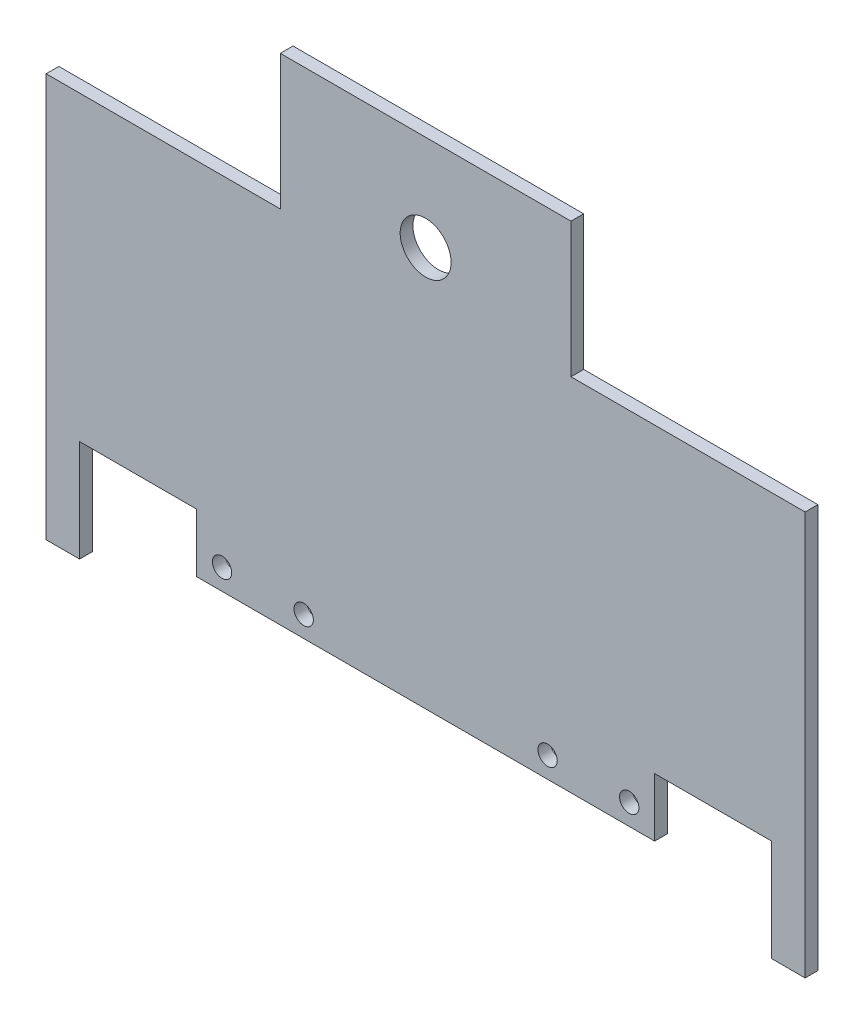
ISO-10303-21;
HEADER;
FILE_DESCRIPTION(('STEP AP214'),'2;1');
FILE_NAME('part.step','',(''),(''),'','','');
FILE_SCHEMA(('AUTOMOTIVE_DESIGN { 1 0 10303 214 1 1 1 1 }'));
ENDSEC;
DATA;
#1=APPLICATION_CONTEXT('core data for automotive mechanical design processes');
#2=APPLICATION_PROTOCOL_DEFINITION('international standard','automotive_design',2000,#1);
#3=PRODUCT_CONTEXT('',#1,'mechanical');
#4=PRODUCT('Part','Part','',(#3));
#5=PRODUCT_RELATED_PRODUCT_CATEGORY('part','',(#4));
#6=PRODUCT_DEFINITION_FORMATION('','',#4);
#7=PRODUCT_DEFINITION_CONTEXT('part definition',#1,'design');
#8=PRODUCT_DEFINITION('design','',#6,#7);
#9=PRODUCT_DEFINITION_SHAPE('','',#8);
#10=(LENGTH_UNIT() NAMED_UNIT(*) SI_UNIT(.MILLI.,.METRE.));
#11=(NAMED_UNIT(*) PLANE_ANGLE_UNIT() SI_UNIT($,.RADIAN.));
#12=(NAMED_UNIT(*) SI_UNIT($,.STERADIAN.) SOLID_ANGLE_UNIT());
#13=UNCERTAINTY_MEASURE_WITH_UNIT(LENGTH_MEASURE(1.E-05),#10,'distance_accuracy_value','');
#14=(GEOMETRIC_REPRESENTATION_CONTEXT(3) GLOBAL_UNCERTAINTY_ASSIGNED_CONTEXT((#13)) GLOBAL_UNIT_ASSIGNED_CONTEXT((#10,
#11,#12)) REPRESENTATION_CONTEXT('',''));
#15=CARTESIAN_POINT('',(0.,0.,0.));
#16=DIRECTION('',(0.,0.,1.));
#17=DIRECTION('',(1.,0.,0.));
#18=AXIS2_PLACEMENT_3D('',#15,#16,#17);
#19=CARTESIAN_POINT('',(0.,0.,3.175));
#20=DIRECTION('',(0.,0.,1.));
#21=DIRECTION('',(1.,0.,0.));
#22=AXIS2_PLACEMENT_3D('',#19,#20,#21);
#23=PLANE('',#22);
#24=CARTESIAN_POINT('',(-52.9106534090909,-24.5679046590909,3.175));
#25=DIRECTION('',(0.,0.,1.));
#26=DIRECTION('',(-1.,0.,0.));
#27=AXIS2_PLACEMENT_3D('',#24,#25,#26);
#28=CIRCLE('',#27,2.413);
#29=CARTESIAN_POINT('',(-55.3236534090909,-24.5679046590909,3.175));
#30=VERTEX_POINT('',#29);
#31=EDGE_CURVE('E350',#30,#30,#28,.T.);
#32=ORIENTED_EDGE('',*,*,#31,.F.);
#33=EDGE_LOOP('',(#32));
#34=FACE_BOUND('',#33,.T.);
#35=CARTESIAN_POINT('',(28.3220150937922,-24.5679046590909,3.175));
#36=DIRECTION('',(0.,0.,1.));
#37=DIRECTION('',(1.,0.,0.));
#38=AXIS2_PLACEMENT_3D('',#35,#36,#37);
#39=CIRCLE('',#38,2.413);
#40=CARTESIAN_POINT('',(30.7350150937922,-24.5679046590909,3.175));
#41=VERTEX_POINT('',#40);
#42=EDGE_CURVE('E362',#41,#41,#39,.T.);
#43=ORIENTED_EDGE('',*,*,#42,.F.);
#44=EDGE_LOOP('',(#43));
#45=FACE_BOUND('',#44,.T.);
#46=DIRECTION('',(0.,1.,0.));
#47=VECTOR('',#46,1.);
#48=CARTESIAN_POINT('',(34.1519507752537,60.1261658208276,3.175));
#49=LINE('',#48,#47);
#50=CARTESIAN_POINT('',(34.1519507752537,60.1261658208276,3.175));
#51=VERTEX_POINT('',#50);
#52=CARTESIAN_POINT('',(34.1519507752537,93.7570312870619,3.175));
#53=VERTEX_POINT('',#52);
#54=EDGE_CURVE('E212',#51,#53,#49,.T.);
#55=ORIENTED_EDGE('',*,*,#54,.T.);
#56=DIRECTION('',(-1.,0.,0.));
#57=VECTOR('',#56,1.);
#58=CARTESIAN_POINT('',(34.1519507752537,93.7570312870619,3.175));
#59=LINE('',#58,#57);
#60=CARTESIAN_POINT('',(-38.3732575934355,93.7570312870619,3.175));
#61=VERTEX_POINT('',#60);
#62=EDGE_CURVE('E118',#53,#61,#59,.T.);
#63=ORIENTED_EDGE('',*,*,#62,.T.);
#64=DIRECTION('',(0.,-1.,0.));
#65=VECTOR('',#64,1.);
#66=CARTESIAN_POINT('',(-38.3732575934355,60.1261658208276,3.175));
#67=LINE('',#66,#65);
#68=CARTESIAN_POINT('',(-38.3732575934355,60.1261658208276,3.175));
#69=VERTEX_POINT('',#68);
#70=EDGE_CURVE('E251',#61,#69,#67,.T.);
#71=ORIENTED_EDGE('',*,*,#70,.T.);
#72=DIRECTION('',(-1.,0.,0.));
#73=VECTOR('',#72,1.);
#74=CARTESIAN_POINT('',(-38.3732575934355,60.1261658208276,3.175));
#75=LINE('',#74,#73);
#76=CARTESIAN_POINT('',(-96.8158838000753,60.1261658208276,3.175));
#77=VERTEX_POINT('',#76);
#78=EDGE_CURVE('E269',#69,#77,#75,.T.);
#79=ORIENTED_EDGE('',*,*,#78,.T.);
#80=DIRECTION('',(0.,-1.,0.));
#81=VECTOR('',#80,1.);
#82=CARTESIAN_POINT('',(-96.8158838000753,60.1261658208276,3.175));
#83=LINE('',#82,#81);
#84=CARTESIAN_POINT('',(-96.8158838000753,-40.5902246590909,3.175));
#85=VERTEX_POINT('',#84);
#86=EDGE_CURVE('E266',#77,#85,#83,.T.);
#87=ORIENTED_EDGE('',*,*,#86,.T.);
#88=DIRECTION('',(1.,0.,0.));
#89=VECTOR('',#88,1.);
#90=CARTESIAN_POINT('',(-88.4706534090909,-40.5902246590909,3.175));
#91=LINE('',#90,#89);
#92=CARTESIAN_POINT('',(-88.4706534090909,-40.5902246590909,3.175));
#93=VERTEX_POINT('',#92);
#94=EDGE_CURVE('E268',#85,#93,#91,.T.);
#95=ORIENTED_EDGE('',*,*,#94,.T.);
#96=DIRECTION('',(0.,1.,0.));
#97=VECTOR('',#96,1.);
#98=CARTESIAN_POINT('',(-88.4706534090909,-15.1902246590909,3.175));
#99=LINE('',#98,#97);
#100=CARTESIAN_POINT('',(-88.4706534090909,-15.1902246590909,3.175));
#101=VERTEX_POINT('',#100);
#102=EDGE_CURVE('E271',#93,#101,#99,.T.);
#103=ORIENTED_EDGE('',*,*,#102,.T.);
#104=DIRECTION('',(1.,0.,0.));
#105=VECTOR('',#104,1.);
#106=CARTESIAN_POINT('',(-59.2606534090909,-15.1902246590909,3.175));
#107=LINE('',#106,#105);
#108=CARTESIAN_POINT('',(-59.2606534090909,-15.1902246590909,3.175));
#109=VERTEX_POINT('',#108);
#110=EDGE_CURVE('E277',#101,#109,#107,.T.);
#111=ORIENTED_EDGE('',*,*,#110,.T.);
#112=DIRECTION('',(0.,-1.,0.));
#113=VECTOR('',#112,1.);
#114=CARTESIAN_POINT('',(-59.2606534090909,-15.1902246590909,3.175));
#115=LINE('',#114,#113);
#116=CARTESIAN_POINT('',(-59.2606534090909,-29.7926846590909,3.175));
#117=VERTEX_POINT('',#116);
#118=EDGE_CURVE('E279',#109,#117,#115,.T.);
#119=ORIENTED_EDGE('',*,*,#118,.T.);
#120=DIRECTION('',(1.,0.,0.));
#121=VECTOR('',#120,1.);
#122=CARTESIAN_POINT('',(-59.2606534090909,-29.7926846590909,3.175));
#123=LINE('',#122,#121);
#124=CARTESIAN_POINT('',(55.0393465909091,-29.7926846590909,3.175));
#125=VERTEX_POINT('',#124);
#126=EDGE_CURVE('E281',#117,#125,#123,.T.);
#127=ORIENTED_EDGE('',*,*,#126,.T.);
#128=DIRECTION('',(0.,1.,0.));
#129=VECTOR('',#128,1.);
#130=CARTESIAN_POINT('',(55.0393465909091,-15.1902246590909,3.175));
#131=LINE('',#130,#129);
#132=CARTESIAN_POINT('',(55.0393465909091,-15.1902246590909,3.175));
#133=VERTEX_POINT('',#132);
#134=EDGE_CURVE('E283',#125,#133,#131,.T.);
#135=ORIENTED_EDGE('',*,*,#134,.T.);
#136=DIRECTION('',(1.,0.,0.));
#137=VECTOR('',#136,1.);
#138=CARTESIAN_POINT('',(55.0393465909091,-15.1902246590909,3.175));
#139=LINE('',#138,#137);
#140=CARTESIAN_POINT('',(84.249346590909,-15.1902246590909,3.175));
#141=VERTEX_POINT('',#140);
#142=EDGE_CURVE('E285',#133,#141,#139,.T.);
#143=ORIENTED_EDGE('',*,*,#142,.T.);
#144=DIRECTION('',(0.,-1.,0.));
#145=VECTOR('',#144,1.);
#146=CARTESIAN_POINT('',(84.249346590909,-15.1902246590909,3.175));
#147=LINE('',#146,#145);
#148=CARTESIAN_POINT('',(84.2493465909091,-40.5902246590909,3.175));
#149=VERTEX_POINT('',#148);
#150=EDGE_CURVE('E161',#141,#149,#147,.T.);
#151=ORIENTED_EDGE('',*,*,#150,.T.);
#152=DIRECTION('',(1.,0.,0.));
#153=VECTOR('',#152,1.);
#154=CARTESIAN_POINT('',(84.2493465909091,-40.5902246590909,3.175));
#155=LINE('',#154,#153);
#156=CARTESIAN_POINT('',(92.5945769818935,-40.5902246590909,3.175));
#157=VERTEX_POINT('',#156);
#158=EDGE_CURVE('E155',#149,#157,#155,.T.);
#159=ORIENTED_EDGE('',*,*,#158,.T.);
#160=DIRECTION('',(0.,1.,0.));
#161=VECTOR('',#160,1.);
#162=CARTESIAN_POINT('',(92.5945769818934,-6.87794744777601,3.175));
#163=LINE('',#162,#161);
#164=CARTESIAN_POINT('',(92.5945769818934,60.1261658208276,3.175));
#165=VERTEX_POINT('',#164);
#166=EDGE_CURVE('E159',#157,#165,#163,.T.);
#167=ORIENTED_EDGE('',*,*,#166,.T.);
#168=DIRECTION('',(-1.,0.,0.));
#169=VECTOR('',#168,1.);
#170=CARTESIAN_POINT('',(92.5945769818934,60.1261658208276,3.175));
#171=LINE('',#170,#169);
#172=EDGE_CURVE('E52',#165,#51,#171,.T.);
#173=ORIENTED_EDGE('',*,*,#172,.T.);
#174=EDGE_LOOP('',(#55,#63,#71,#79,#87,#95,#103,#111,#119,#127,#135,#143,#151,#159,#167,#173));
#175=FACE_BOUND('',#174,.T.);
#176=CARTESIAN_POINT('',(48.6893465909091,-24.5679046590909,3.175));
#177=DIRECTION('',(0.,0.,1.));
#178=DIRECTION('',(1.,0.,0.));
#179=AXIS2_PLACEMENT_3D('',#176,#177,#178);
#180=CIRCLE('',#179,2.413);
#181=CARTESIAN_POINT('',(51.1023465909091,-24.5679046590909,3.175));
#182=VERTEX_POINT('',#181);
#183=EDGE_CURVE('E184',#182,#182,#180,.T.);
#184=ORIENTED_EDGE('',*,*,#183,.F.);
#185=EDGE_LOOP('',(#184));
#186=FACE_BOUND('',#185,.T.);
#187=CARTESIAN_POINT('',(-32.543321911974,-24.5679046590909,3.175));
#188=DIRECTION('',(0.,0.,1.));
#189=DIRECTION('',(-1.,0.,0.));
#190=AXIS2_PLACEMENT_3D('',#187,#188,#189);
#191=CIRCLE('',#190,2.41300000000001);
#192=CARTESIAN_POINT('',(-34.956321911974,-24.5679046590909,3.175));
#193=VERTEX_POINT('',#192);
#194=EDGE_CURVE('E356',#193,#193,#191,.T.);
#195=ORIENTED_EDGE('',*,*,#194,.F.);
#196=EDGE_LOOP('',(#195));
#197=FACE_BOUND('',#196,.T.);
#198=CARTESIAN_POINT('',(-2.11065340909093,69.8925240613448,3.175));
#199=DIRECTION('',(0.,0.,1.));
#200=DIRECTION('',(1.,0.,0.));
#201=AXIS2_PLACEMENT_3D('',#198,#199,#200);
#202=CIRCLE('',#201,6.35);
#203=CARTESIAN_POINT('',(4.23934659090907,69.8925240613448,3.175));
#204=VERTEX_POINT('',#203);
#205=EDGE_CURVE('E341',#204,#204,#202,.T.);
#206=ORIENTED_EDGE('',*,*,#205,.F.);
#207=EDGE_LOOP('',(#206));
#208=FACE_BOUND('',#207,.T.);
#209=ADVANCED_FACE('F35',(#34,#45,#175,#186,#197,#208),#23,.T.);
#210=CARTESIAN_POINT('',(0.,0.,0.));
#211=DIRECTION('',(0.,0.,1.));
#212=DIRECTION('',(1.,0.,0.));
#213=AXIS2_PLACEMENT_3D('',#210,#211,#212);
#214=PLANE('',#213);
#215=CARTESIAN_POINT('',(-52.9106534090909,-24.5679046590909,0.));
#216=DIRECTION('',(0.,0.,1.));
#217=DIRECTION('',(-1.,0.,0.));
#218=AXIS2_PLACEMENT_3D('',#215,#216,#217);
#219=CIRCLE('',#218,2.413);
#220=CARTESIAN_POINT('',(-55.3236534090909,-24.5679046590909,0.));
#221=VERTEX_POINT('',#220);
#222=EDGE_CURVE('E347',#221,#221,#219,.T.);
#223=ORIENTED_EDGE('',*,*,#222,.T.);
#224=EDGE_LOOP('',(#223));
#225=FACE_BOUND('',#224,.T.);
#226=CARTESIAN_POINT('',(28.3220150937922,-24.5679046590909,0.));
#227=DIRECTION('',(0.,0.,1.));
#228=DIRECTION('',(1.,0.,0.));
#229=AXIS2_PLACEMENT_3D('',#226,#227,#228);
#230=CIRCLE('',#229,2.413);
#231=CARTESIAN_POINT('',(30.7350150937922,-24.5679046590909,0.));
#232=VERTEX_POINT('',#231);
#233=EDGE_CURVE('E359',#232,#232,#230,.T.);
#234=ORIENTED_EDGE('',*,*,#233,.T.);
#235=EDGE_LOOP('',(#234));
#236=FACE_BOUND('',#235,.T.);
#237=DIRECTION('',(0.,1.,0.));
#238=VECTOR('',#237,1.);
#239=CARTESIAN_POINT('',(34.1519507752537,60.1261658208276,0.));
#240=LINE('',#239,#238);
#241=CARTESIAN_POINT('',(34.1519507752537,60.1261658208276,0.));
#242=VERTEX_POINT('',#241);
#243=CARTESIAN_POINT('',(34.1519507752537,93.7570312870619,0.));
#244=VERTEX_POINT('',#243);
#245=EDGE_CURVE('E180',#242,#244,#240,.T.);
#246=ORIENTED_EDGE('',*,*,#245,.F.);
#247=DIRECTION('',(-1.,0.,0.));
#248=VECTOR('',#247,1.);
#249=CARTESIAN_POINT('',(92.5945769818934,60.1261658208276,0.));
#250=LINE('',#249,#248);
#251=CARTESIAN_POINT('',(92.5945769818934,60.1261658208276,0.));
#252=VERTEX_POINT('',#251);
#253=EDGE_CURVE('E110',#252,#242,#250,.T.);
#254=ORIENTED_EDGE('',*,*,#253,.F.);
#255=DIRECTION('',(0.,1.,0.));
#256=VECTOR('',#255,1.);
#257=CARTESIAN_POINT('',(92.5945769818934,-6.87794744777601,0.));
#258=LINE('',#257,#256);
#259=CARTESIAN_POINT('',(92.5945769818935,-40.5902246590909,0.));
#260=VERTEX_POINT('',#259);
#261=EDGE_CURVE('E104',#260,#252,#258,.T.);
#262=ORIENTED_EDGE('',*,*,#261,.F.);
#263=DIRECTION('',(1.,0.,0.));
#264=VECTOR('',#263,1.);
#265=CARTESIAN_POINT('',(84.2493465909091,-40.5902246590909,0.));
#266=LINE('',#265,#264);
#267=CARTESIAN_POINT('',(84.2493465909091,-40.5902246590909,0.));
#268=VERTEX_POINT('',#267);
#269=EDGE_CURVE('E170',#268,#260,#266,.T.);
#270=ORIENTED_EDGE('',*,*,#269,.F.);
#271=DIRECTION('',(0.,-1.,0.));
#272=VECTOR('',#271,1.);
#273=CARTESIAN_POINT('',(84.249346590909,-15.1902246590909,0.));
#274=LINE('',#273,#272);
#275=CARTESIAN_POINT('',(84.249346590909,-15.1902246590909,0.));
#276=VERTEX_POINT('',#275);
#277=EDGE_CURVE('E207',#276,#268,#274,.T.);
#278=ORIENTED_EDGE('',*,*,#277,.F.);
#279=DIRECTION('',(1.,0.,0.));
#280=VECTOR('',#279,1.);
#281=CARTESIAN_POINT('',(55.0393465909091,-15.1902246590909,0.));
#282=LINE('',#281,#280);
#283=CARTESIAN_POINT('',(55.0393465909091,-15.1902246590909,0.));
#284=VERTEX_POINT('',#283);
#285=EDGE_CURVE('E205',#284,#276,#282,.T.);
#286=ORIENTED_EDGE('',*,*,#285,.F.);
#287=DIRECTION('',(0.,1.,0.));
#288=VECTOR('',#287,1.);
#289=CARTESIAN_POINT('',(55.0393465909091,-15.1902246590909,0.));
#290=LINE('',#289,#288);
#291=CARTESIAN_POINT('',(55.0393465909091,-29.7926846590909,0.));
#292=VERTEX_POINT('',#291);
#293=EDGE_CURVE('E203',#292,#284,#290,.T.);
#294=ORIENTED_EDGE('',*,*,#293,.F.);
#295=DIRECTION('',(1.,0.,0.));
#296=VECTOR('',#295,1.);
#297=CARTESIAN_POINT('',(-59.2606534090909,-29.7926846590909,0.));
#298=LINE('',#297,#296);
#299=CARTESIAN_POINT('',(-59.2606534090909,-29.7926846590909,0.));
#300=VERTEX_POINT('',#299);
#301=EDGE_CURVE('E201',#300,#292,#298,.T.);
#302=ORIENTED_EDGE('',*,*,#301,.F.);
#303=DIRECTION('',(0.,-1.,0.));
#304=VECTOR('',#303,1.);
#305=CARTESIAN_POINT('',(-59.2606534090909,-15.1902246590909,0.));
#306=LINE('',#305,#304);
#307=CARTESIAN_POINT('',(-59.2606534090909,-15.1902246590909,0.));
#308=VERTEX_POINT('',#307);
#309=EDGE_CURVE('E199',#308,#300,#306,.T.);
#310=ORIENTED_EDGE('',*,*,#309,.F.);
#311=DIRECTION('',(1.,0.,0.));
#312=VECTOR('',#311,1.);
#313=CARTESIAN_POINT('',(-59.2606534090909,-15.1902246590909,0.));
#314=LINE('',#313,#312);
#315=CARTESIAN_POINT('',(-88.4706534090909,-15.1902246590909,0.));
#316=VERTEX_POINT('',#315);
#317=EDGE_CURVE('E197',#316,#308,#314,.T.);
#318=ORIENTED_EDGE('',*,*,#317,.F.);
#319=DIRECTION('',(0.,1.,0.));
#320=VECTOR('',#319,1.);
#321=CARTESIAN_POINT('',(-88.4706534090909,-15.1902246590909,0.));
#322=LINE('',#321,#320);
#323=CARTESIAN_POINT('',(-88.4706534090909,-40.5902246590909,0.));
#324=VERTEX_POINT('',#323);
#325=EDGE_CURVE('E195',#324,#316,#322,.T.);
#326=ORIENTED_EDGE('',*,*,#325,.F.);
#327=DIRECTION('',(1.,0.,0.));
#328=VECTOR('',#327,1.);
#329=CARTESIAN_POINT('',(-88.4706534090909,-40.5902246590909,0.));
#330=LINE('',#329,#328);
#331=CARTESIAN_POINT('',(-96.8158838000753,-40.5902246590909,0.));
#332=VERTEX_POINT('',#331);
#333=EDGE_CURVE('E193',#332,#324,#330,.T.);
#334=ORIENTED_EDGE('',*,*,#333,.F.);
#335=DIRECTION('',(0.,-1.,0.));
#336=VECTOR('',#335,1.);
#337=CARTESIAN_POINT('',(-96.8158838000753,-6.87794744777604,0.));
#338=LINE('',#337,#336);
#339=CARTESIAN_POINT('',(-96.8158838000753,60.1261658208276,0.));
#340=VERTEX_POINT('',#339);
#341=EDGE_CURVE('E191',#340,#332,#338,.T.);
#342=ORIENTED_EDGE('',*,*,#341,.F.);
#343=DIRECTION('',(-1.,0.,0.));
#344=VECTOR('',#343,1.);
#345=CARTESIAN_POINT('',(-38.3732575934355,60.1261658208276,0.));
#346=LINE('',#345,#344);
#347=CARTESIAN_POINT('',(-38.3732575934355,60.1261658208276,0.));
#348=VERTEX_POINT('',#347);
#349=EDGE_CURVE('E188',#348,#340,#346,.T.);
#350=ORIENTED_EDGE('',*,*,#349,.F.);
#351=DIRECTION('',(0.,-1.,0.));
#352=VECTOR('',#351,1.);
#353=CARTESIAN_POINT('',(-38.3732575934355,60.1261658208276,0.));
#354=LINE('',#353,#352);
#355=CARTESIAN_POINT('',(-38.3732575934355,93.7570312870619,0.));
#356=VERTEX_POINT('',#355);
#357=EDGE_CURVE('E186',#356,#348,#354,.T.);
#358=ORIENTED_EDGE('',*,*,#357,.F.);
#359=DIRECTION('',(-1.,0.,0.));
#360=VECTOR('',#359,1.);
#361=CARTESIAN_POINT('',(34.1519507752537,93.7570312870619,0.));
#362=LINE('',#361,#360);
#363=EDGE_CURVE('E183',#244,#356,#362,.T.);
#364=ORIENTED_EDGE('',*,*,#363,.F.);
#365=EDGE_LOOP('',(#246,#254,#262,#270,#278,#286,#294,#302,#310,#318,#326,#334,#342,#350,#358,#364));
#366=FACE_BOUND('',#365,.T.);
#367=CARTESIAN_POINT('',(48.6893465909091,-24.5679046590909,0.));
#368=DIRECTION('',(0.,0.,1.));
#369=DIRECTION('',(1.,0.,0.));
#370=AXIS2_PLACEMENT_3D('',#367,#368,#369);
#371=CIRCLE('',#370,2.413);
#372=CARTESIAN_POINT('',(51.1023465909091,-24.5679046590909,0.));
#373=VERTEX_POINT('',#372);
#374=EDGE_CURVE('E365',#373,#373,#371,.T.);
#375=ORIENTED_EDGE('',*,*,#374,.T.);
#376=EDGE_LOOP('',(#375));
#377=FACE_BOUND('',#376,.T.);
#378=CARTESIAN_POINT('',(-32.543321911974,-24.5679046590909,0.));
#379=DIRECTION('',(0.,0.,1.));
#380=DIRECTION('',(-1.,0.,0.));
#381=AXIS2_PLACEMENT_3D('',#378,#379,#380);
#382=CIRCLE('',#381,2.41300000000001);
#383=CARTESIAN_POINT('',(-34.956321911974,-24.5679046590909,0.));
#384=VERTEX_POINT('',#383);
#385=EDGE_CURVE('E353',#384,#384,#382,.T.);
#386=ORIENTED_EDGE('',*,*,#385,.T.);
#387=EDGE_LOOP('',(#386));
#388=FACE_BOUND('',#387,.T.);
#389=CARTESIAN_POINT('',(-2.11065340909093,69.8925240613448,0.));
#390=DIRECTION('',(0.,0.,1.));
#391=DIRECTION('',(1.,0.,0.));
#392=AXIS2_PLACEMENT_3D('',#389,#390,#391);
#393=CIRCLE('',#392,6.35);
#394=CARTESIAN_POINT('',(4.23934659090907,69.8925240613448,0.));
#395=VERTEX_POINT('',#394);
#396=EDGE_CURVE('E344',#395,#395,#393,.T.);
#397=ORIENTED_EDGE('',*,*,#396,.T.);
#398=EDGE_LOOP('',(#397));
#399=FACE_BOUND('',#398,.T.);
#400=ADVANCED_FACE('F255',(#225,#236,#366,#377,#388,#399),#214,.F.);
#401=CARTESIAN_POINT('',(34.1519507752537,60.1261658208276,3.175));
#402=DIRECTION('',(-1.,0.,0.));
#403=DIRECTION('',(0.,0.,1.));
#404=AXIS2_PLACEMENT_3D('',#401,#402,#403);
#405=PLANE('',#404);
#406=ORIENTED_EDGE('',*,*,#245,.T.);
#407=DIRECTION('',(0.,0.,-1.));
#408=VECTOR('',#407,1.);
#409=CARTESIAN_POINT('',(34.1519507752537,93.7570312870619,3.175));
#410=LINE('',#409,#408);
#411=EDGE_CURVE('E11',#53,#244,#410,.T.);
#412=ORIENTED_EDGE('',*,*,#411,.F.);
#413=ORIENTED_EDGE('',*,*,#54,.F.);
#414=DIRECTION('',(0.,0.,-1.));
#415=VECTOR('',#414,1.);
#416=CARTESIAN_POINT('',(34.1519507752537,60.1261658208276,3.175));
#417=LINE('',#416,#415);
#418=EDGE_CURVE('E176',#51,#242,#417,.T.);
#419=ORIENTED_EDGE('',*,*,#418,.T.);
#420=EDGE_LOOP('',(#406,#412,#413,#419));
#421=FACE_BOUND('',#420,.T.);
#422=ADVANCED_FACE('F37',(#421),#405,.F.);
#423=CARTESIAN_POINT('',(34.1519507752537,93.7570312870619,3.175));
#424=DIRECTION('',(0.,-1.,0.));
#425=DIRECTION('',(0.,0.,-1.));
#426=AXIS2_PLACEMENT_3D('',#423,#424,#425);
#427=PLANE('',#426);
#428=ORIENTED_EDGE('',*,*,#363,.T.);
#429=DIRECTION('',(0.,0.,-1.));
#430=VECTOR('',#429,1.);
#431=CARTESIAN_POINT('',(-38.3732575934355,93.7570312870619,3.175));
#432=LINE('',#431,#430);
#433=EDGE_CURVE('E44',#61,#356,#432,.T.);
#434=ORIENTED_EDGE('',*,*,#433,.F.);
#435=ORIENTED_EDGE('',*,*,#62,.F.);
#436=ORIENTED_EDGE('',*,*,#411,.T.);
#437=EDGE_LOOP('',(#428,#434,#435,#436));
#438=FACE_BOUND('',#437,.T.);
#439=ADVANCED_FACE('F525',(#438),#427,.F.);
#440=CARTESIAN_POINT('',(-38.3732575934355,60.1261658208276,3.175));
#441=DIRECTION('',(1.,0.,0.));
#442=DIRECTION('',(0.,0.,-1.));
#443=AXIS2_PLACEMENT_3D('',#440,#441,#442);
#444=PLANE('',#443);
#445=ORIENTED_EDGE('',*,*,#357,.T.);
#446=DIRECTION('',(0.,0.,-1.));
#447=VECTOR('',#446,1.);
#448=CARTESIAN_POINT('',(-38.3732575934355,60.1261658208276,3.175));
#449=LINE('',#448,#447);
#450=EDGE_CURVE('E243',#69,#348,#449,.T.);
#451=ORIENTED_EDGE('',*,*,#450,.F.);
#452=ORIENTED_EDGE('',*,*,#70,.F.);
#453=ORIENTED_EDGE('',*,*,#433,.T.);
#454=EDGE_LOOP('',(#445,#451,#452,#453));
#455=FACE_BOUND('',#454,.T.);
#456=ADVANCED_FACE('F249',(#455),#444,.F.);
#457=CARTESIAN_POINT('',(-38.3732575934355,60.1261658208276,3.175));
#458=DIRECTION('',(0.,-1.,0.));
#459=DIRECTION('',(0.,0.,-1.));
#460=AXIS2_PLACEMENT_3D('',#457,#458,#459);
#461=PLANE('',#460);
#462=ORIENTED_EDGE('',*,*,#349,.T.);
#463=DIRECTION('',(0.,0.,-1.));
#464=VECTOR('',#463,1.);
#465=CARTESIAN_POINT('',(-96.8158838000753,60.1261658208276,3.175));
#466=LINE('',#465,#464);
#467=EDGE_CURVE('E240',#77,#340,#466,.T.);
#468=ORIENTED_EDGE('',*,*,#467,.F.);
#469=ORIENTED_EDGE('',*,*,#78,.F.);
#470=ORIENTED_EDGE('',*,*,#450,.T.);
#471=EDGE_LOOP('',(#462,#468,#469,#470));
#472=FACE_BOUND('',#471,.T.);
#473=ADVANCED_FACE('F260',(#472),#461,.F.);
#474=CARTESIAN_POINT('',(-96.8158838000753,-6.87794744777604,3.175));
#475=DIRECTION('',(1.,0.,0.));
#476=DIRECTION('',(0.,0.,-1.));
#477=AXIS2_PLACEMENT_3D('',#474,#475,#476);
#478=PLANE('',#477);
#479=ORIENTED_EDGE('',*,*,#341,.T.);
#480=DIRECTION('',(0.,0.,-1.));
#481=VECTOR('',#480,1.);
#482=CARTESIAN_POINT('',(-96.8158838000753,-40.5902246590909,3.175));
#483=LINE('',#482,#481);
#484=EDGE_CURVE('E237',#85,#332,#483,.T.);
#485=ORIENTED_EDGE('',*,*,#484,.F.);
#486=ORIENTED_EDGE('',*,*,#86,.F.);
#487=ORIENTED_EDGE('',*,*,#467,.T.);
#488=EDGE_LOOP('',(#479,#485,#486,#487));
#489=FACE_BOUND('',#488,.T.);
#490=ADVANCED_FACE('F264',(#489),#478,.F.);
#491=CARTESIAN_POINT('',(-88.4706534090909,-40.5902246590909,3.175));
#492=DIRECTION('',(0.,1.,0.));
#493=DIRECTION('',(0.,0.,1.));
#494=AXIS2_PLACEMENT_3D('',#491,#492,#493);
#495=PLANE('',#494);
#496=ORIENTED_EDGE('',*,*,#333,.T.);
#497=DIRECTION('',(0.,0.,-1.));
#498=VECTOR('',#497,1.);
#499=CARTESIAN_POINT('',(-88.4706534090909,-40.5902246590909,3.175));
#500=LINE('',#499,#498);
#501=EDGE_CURVE('E234',#93,#324,#500,.T.);
#502=ORIENTED_EDGE('',*,*,#501,.F.);
#503=ORIENTED_EDGE('',*,*,#94,.F.);
#504=ORIENTED_EDGE('',*,*,#484,.T.);
#505=EDGE_LOOP('',(#496,#502,#503,#504));
#506=FACE_BOUND('',#505,.T.);
#507=ADVANCED_FACE('F489',(#506),#495,.F.);
#508=CARTESIAN_POINT('',(-88.4706534090909,-15.1902246590909,3.175));
#509=DIRECTION('',(-1.,0.,0.));
#510=DIRECTION('',(0.,-1.,0.));
#511=AXIS2_PLACEMENT_3D('',#508,#509,#510);
#512=PLANE('',#511);
#513=ORIENTED_EDGE('',*,*,#325,.T.);
#514=DIRECTION('',(0.,0.,-1.));
#515=VECTOR('',#514,1.);
#516=CARTESIAN_POINT('',(-88.4706534090909,-15.1902246590909,3.175));
#517=LINE('',#516,#515);
#518=EDGE_CURVE('E231',#101,#316,#517,.T.);
#519=ORIENTED_EDGE('',*,*,#518,.F.);
#520=ORIENTED_EDGE('',*,*,#102,.F.);
#521=ORIENTED_EDGE('',*,*,#501,.T.);
#522=EDGE_LOOP('',(#513,#519,#520,#521));
#523=FACE_BOUND('',#522,.T.);
#524=ADVANCED_FACE('F479',(#523),#512,.F.);
#525=CARTESIAN_POINT('',(-59.2606534090909,-15.1902246590909,3.175));
#526=DIRECTION('',(0.,1.,0.));
#527=DIRECTION('',(-1.,0.,0.));
#528=AXIS2_PLACEMENT_3D('',#525,#526,#527);
#529=PLANE('',#528);
#530=ORIENTED_EDGE('',*,*,#317,.T.);
#531=DIRECTION('',(0.,0.,-1.));
#532=VECTOR('',#531,1.);
#533=CARTESIAN_POINT('',(-59.2606534090909,-15.1902246590909,3.175));
#534=LINE('',#533,#532);
#535=EDGE_CURVE('E228',#109,#308,#534,.T.);
#536=ORIENTED_EDGE('',*,*,#535,.F.);
#537=ORIENTED_EDGE('',*,*,#110,.F.);
#538=ORIENTED_EDGE('',*,*,#518,.T.);
#539=EDGE_LOOP('',(#530,#536,#537,#538));
#540=FACE_BOUND('',#539,.T.);
#541=ADVANCED_FACE('F469',(#540),#529,.F.);
#542=CARTESIAN_POINT('',(-59.2606534090909,-15.1902246590909,3.175));
#543=DIRECTION('',(1.,0.,0.));
#544=DIRECTION('',(0.,1.,0.));
#545=AXIS2_PLACEMENT_3D('',#542,#543,#544);
#546=PLANE('',#545);
#547=ORIENTED_EDGE('',*,*,#309,.T.);
#548=DIRECTION('',(0.,0.,-1.));
#549=VECTOR('',#548,1.);
#550=CARTESIAN_POINT('',(-59.2606534090909,-29.7926846590909,3.175));
#551=LINE('',#550,#549);
#552=EDGE_CURVE('E225',#117,#300,#551,.T.);
#553=ORIENTED_EDGE('',*,*,#552,.F.);
#554=ORIENTED_EDGE('',*,*,#118,.F.);
#555=ORIENTED_EDGE('',*,*,#535,.T.);
#556=EDGE_LOOP('',(#547,#553,#554,#555));
#557=FACE_BOUND('',#556,.T.);
#558=ADVANCED_FACE('F459',(#557),#546,.F.);
#559=CARTESIAN_POINT('',(-59.2606534090909,-29.7926846590909,3.175));
#560=DIRECTION('',(0.,1.,0.));
#561=DIRECTION('',(0.,0.,1.));
#562=AXIS2_PLACEMENT_3D('',#559,#560,#561);
#563=PLANE('',#562);
#564=ORIENTED_EDGE('',*,*,#301,.T.);
#565=DIRECTION('',(0.,0.,-1.));
#566=VECTOR('',#565,1.);
#567=CARTESIAN_POINT('',(55.0393465909091,-29.7926846590909,3.175));
#568=LINE('',#567,#566);
#569=EDGE_CURVE('E222',#125,#292,#568,.T.);
#570=ORIENTED_EDGE('',*,*,#569,.F.);
#571=ORIENTED_EDGE('',*,*,#126,.F.);
#572=ORIENTED_EDGE('',*,*,#552,.T.);
#573=EDGE_LOOP('',(#564,#570,#571,#572));
#574=FACE_BOUND('',#573,.T.);
#575=ADVANCED_FACE('F449',(#574),#563,.F.);
#576=CARTESIAN_POINT('',(55.0393465909091,-15.1902246590909,3.175));
#577=DIRECTION('',(-1.,0.,0.));
#578=DIRECTION('',(0.,-1.,0.));
#579=AXIS2_PLACEMENT_3D('',#576,#577,#578);
#580=PLANE('',#579);
#581=ORIENTED_EDGE('',*,*,#293,.T.);
#582=DIRECTION('',(0.,0.,-1.));
#583=VECTOR('',#582,1.);
#584=CARTESIAN_POINT('',(55.0393465909091,-15.1902246590909,3.175));
#585=LINE('',#584,#583);
#586=EDGE_CURVE('E219',#133,#284,#585,.T.);
#587=ORIENTED_EDGE('',*,*,#586,.F.);
#588=ORIENTED_EDGE('',*,*,#134,.F.);
#589=ORIENTED_EDGE('',*,*,#569,.T.);
#590=EDGE_LOOP('',(#581,#587,#588,#589));
#591=FACE_BOUND('',#590,.T.);
#592=ADVANCED_FACE('F440',(#591),#580,.F.);
#593=CARTESIAN_POINT('',(55.0393465909091,-15.1902246590909,3.175));
#594=DIRECTION('',(0.,1.,0.));
#595=DIRECTION('',(-1.,0.,0.));
#596=AXIS2_PLACEMENT_3D('',#593,#594,#595);
#597=PLANE('',#596);
#598=ORIENTED_EDGE('',*,*,#285,.T.);
#599=DIRECTION('',(0.,0.,-1.));
#600=VECTOR('',#599,1.);
#601=CARTESIAN_POINT('',(84.249346590909,-15.1902246590909,3.175));
#602=LINE('',#601,#600);
#603=EDGE_CURVE('E216',#141,#276,#602,.T.);
#604=ORIENTED_EDGE('',*,*,#603,.F.);
#605=ORIENTED_EDGE('',*,*,#142,.F.);
#606=ORIENTED_EDGE('',*,*,#586,.T.);
#607=EDGE_LOOP('',(#598,#604,#605,#606));
#608=FACE_BOUND('',#607,.T.);
#609=ADVANCED_FACE('F291',(#608),#597,.F.);
#610=CARTESIAN_POINT('',(84.249346590909,-15.1902246590909,3.175));
#611=DIRECTION('',(1.,0.,0.));
#612=DIRECTION('',(0.,1.,0.));
#613=AXIS2_PLACEMENT_3D('',#610,#611,#612);
#614=PLANE('',#613);
#615=ORIENTED_EDGE('',*,*,#277,.T.);
#616=DIRECTION('',(0.,0.,-1.));
#617=VECTOR('',#616,1.);
#618=CARTESIAN_POINT('',(84.2493465909091,-40.5902246590909,3.175));
#619=LINE('',#618,#617);
#620=EDGE_CURVE('E171',#149,#268,#619,.T.);
#621=ORIENTED_EDGE('',*,*,#620,.F.);
#622=ORIENTED_EDGE('',*,*,#150,.F.);
#623=ORIENTED_EDGE('',*,*,#603,.T.);
#624=EDGE_LOOP('',(#615,#621,#622,#623));
#625=FACE_BOUND('',#624,.T.);
#626=ADVANCED_FACE('F295',(#625),#614,.F.);
#627=CARTESIAN_POINT('',(84.2493465909091,-40.5902246590909,3.175));
#628=DIRECTION('',(0.,1.,0.));
#629=DIRECTION('',(0.,0.,1.));
#630=AXIS2_PLACEMENT_3D('',#627,#628,#629);
#631=PLANE('',#630);
#632=ORIENTED_EDGE('',*,*,#269,.T.);
#633=DIRECTION('',(0.,0.,-1.));
#634=VECTOR('',#633,1.);
#635=CARTESIAN_POINT('',(92.5945769818935,-40.5902246590909,3.175));
#636=LINE('',#635,#634);
#637=EDGE_CURVE('E167',#157,#260,#636,.T.);
#638=ORIENTED_EDGE('',*,*,#637,.F.);
#639=ORIENTED_EDGE('',*,*,#158,.F.);
#640=ORIENTED_EDGE('',*,*,#620,.T.);
#641=EDGE_LOOP('',(#632,#638,#639,#640));
#642=FACE_BOUND('',#641,.T.);
#643=ADVANCED_FACE('F168',(#642),#631,.F.);
#644=CARTESIAN_POINT('',(92.5945769818934,-6.87794744777601,3.175));
#645=DIRECTION('',(-1.,0.,0.));
#646=DIRECTION('',(0.,0.,1.));
#647=AXIS2_PLACEMENT_3D('',#644,#645,#646);
#648=PLANE('',#647);
#649=ORIENTED_EDGE('',*,*,#261,.T.);
#650=DIRECTION('',(0.,0.,-1.));
#651=VECTOR('',#650,1.);
#652=CARTESIAN_POINT('',(92.5945769818934,60.1261658208276,3.175));
#653=LINE('',#652,#651);
#654=EDGE_CURVE('E172',#165,#252,#653,.T.);
#655=ORIENTED_EDGE('',*,*,#654,.F.);
#656=ORIENTED_EDGE('',*,*,#166,.F.);
#657=ORIENTED_EDGE('',*,*,#637,.T.);
#658=EDGE_LOOP('',(#649,#655,#656,#657));
#659=FACE_BOUND('',#658,.T.);
#660=ADVANCED_FACE('F174',(#659),#648,.F.);
#661=CARTESIAN_POINT('',(92.5945769818934,60.1261658208276,3.175));
#662=DIRECTION('',(0.,-1.,0.));
#663=DIRECTION('',(0.,0.,-1.));
#664=AXIS2_PLACEMENT_3D('',#661,#662,#663);
#665=PLANE('',#664);
#666=ORIENTED_EDGE('',*,*,#253,.T.);
#667=ORIENTED_EDGE('',*,*,#418,.F.);
#668=ORIENTED_EDGE('',*,*,#172,.F.);
#669=ORIENTED_EDGE('',*,*,#654,.T.);
#670=EDGE_LOOP('',(#666,#667,#668,#669));
#671=FACE_BOUND('',#670,.T.);
#672=ADVANCED_FACE('F299',(#671),#665,.F.);
#673=CARTESIAN_POINT('',(48.6893465909091,-24.5679046590909,3.175));
#674=DIRECTION('',(0.,0.,-1.));
#675=DIRECTION('',(-1.,0.,0.));
#676=AXIS2_PLACEMENT_3D('',#673,#674,#675);
#677=CYLINDRICAL_SURFACE('',#676,2.413);
#678=ORIENTED_EDGE('',*,*,#183,.T.);
#679=EDGE_LOOP('',(#678));
#680=FACE_BOUND('',#679,.T.);
#681=ORIENTED_EDGE('',*,*,#374,.F.);
#682=EDGE_LOOP('',(#681));
#683=FACE_BOUND('',#682,.T.);
#684=ADVANCED_FACE('F301',(#680,#683),#677,.F.);
#685=CARTESIAN_POINT('',(28.3220150937922,-24.5679046590909,3.175));
#686=DIRECTION('',(0.,0.,-1.));
#687=DIRECTION('',(-1.,0.,0.));
#688=AXIS2_PLACEMENT_3D('',#685,#686,#687);
#689=CYLINDRICAL_SURFACE('',#688,2.413);
#690=ORIENTED_EDGE('',*,*,#42,.T.);
#691=EDGE_LOOP('',(#690));
#692=FACE_BOUND('',#691,.T.);
#693=ORIENTED_EDGE('',*,*,#233,.F.);
#694=EDGE_LOOP('',(#693));
#695=FACE_BOUND('',#694,.T.);
#696=ADVANCED_FACE('F307',(#692,#695),#689,.F.);
#697=CARTESIAN_POINT('',(-32.543321911974,-24.5679046590909,3.175));
#698=DIRECTION('',(0.,0.,-1.));
#699=DIRECTION('',(-1.,0.,0.));
#700=AXIS2_PLACEMENT_3D('',#697,#698,#699);
#701=CYLINDRICAL_SURFACE('',#700,2.41300000000001);
#702=ORIENTED_EDGE('',*,*,#194,.T.);
#703=EDGE_LOOP('',(#702));
#704=FACE_BOUND('',#703,.T.);
#705=ORIENTED_EDGE('',*,*,#385,.F.);
#706=EDGE_LOOP('',(#705));
#707=FACE_BOUND('',#706,.T.);
#708=ADVANCED_FACE('F324',(#704,#707),#701,.F.);
#709=CARTESIAN_POINT('',(-52.9106534090909,-24.5679046590909,3.175));
#710=DIRECTION('',(0.,0.,-1.));
#711=DIRECTION('',(-1.,0.,0.));
#712=AXIS2_PLACEMENT_3D('',#709,#710,#711);
#713=CYLINDRICAL_SURFACE('',#712,2.413);
#714=ORIENTED_EDGE('',*,*,#31,.T.);
#715=EDGE_LOOP('',(#714));
#716=FACE_BOUND('',#715,.T.);
#717=ORIENTED_EDGE('',*,*,#222,.F.);
#718=EDGE_LOOP('',(#717));
#719=FACE_BOUND('',#718,.T.);
#720=ADVANCED_FACE('F328',(#716,#719),#713,.F.);
#721=CARTESIAN_POINT('',(-2.11065340909093,69.8925240613448,3.175));
#722=DIRECTION('',(0.,0.,-1.));
#723=DIRECTION('',(-1.,0.,0.));
#724=AXIS2_PLACEMENT_3D('',#721,#722,#723);
#725=CYLINDRICAL_SURFACE('',#724,6.35);
#726=ORIENTED_EDGE('',*,*,#205,.T.);
#727=EDGE_LOOP('',(#726));
#728=FACE_BOUND('',#727,.T.);
#729=ORIENTED_EDGE('',*,*,#396,.F.);
#730=EDGE_LOOP('',(#729));
#731=FACE_BOUND('',#730,.T.);
#732=ADVANCED_FACE('F332',(#728,#731),#725,.F.);
#733=CLOSED_SHELL('',(#209,#400,#422,#439,#456,#473,#490,#507,#524,#541,#558,#575,#592,#609,
#626,#643,#660,#672,#684,#696,#708,#720,#732));
#734=MANIFOLD_SOLID_BREP('B2',#733);
#735=ADVANCED_BREP_SHAPE_REPRESENTATION('',(#18,#734),#14);
#736=SHAPE_DEFINITION_REPRESENTATION(#9,#735);
ENDSEC;
END-ISO-10303-21;
